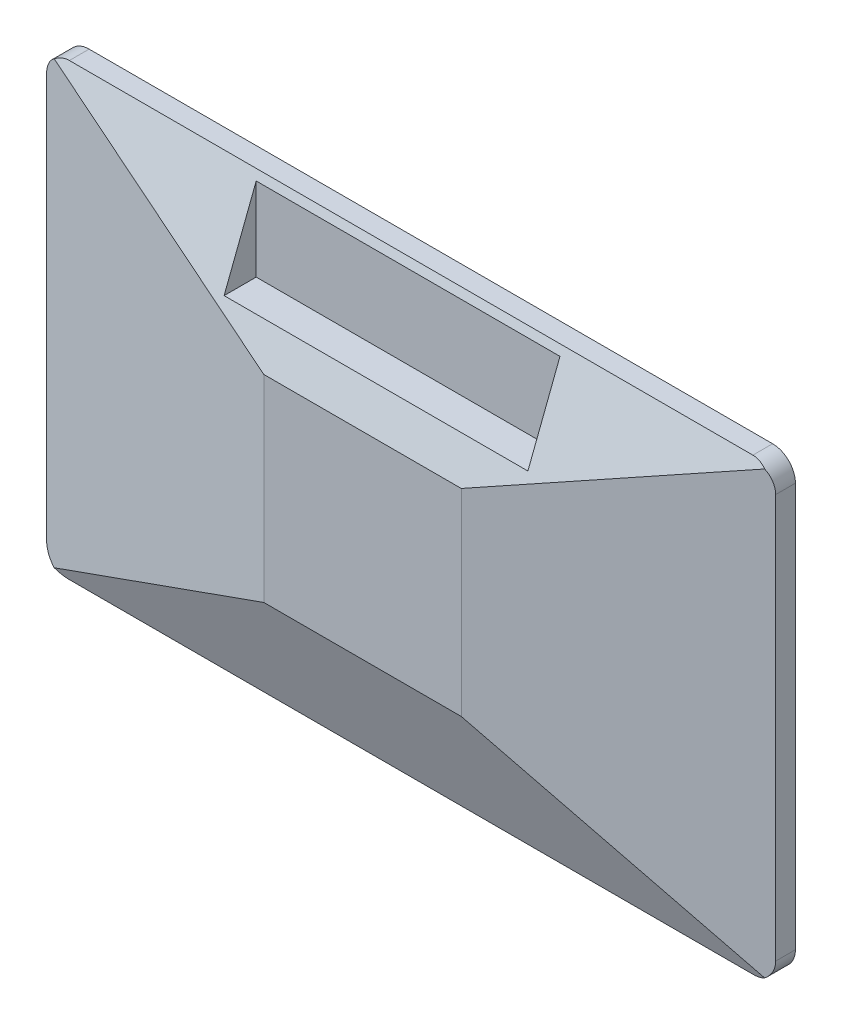
ISO-10303-21;
HEADER;
FILE_DESCRIPTION(('STEP AP214'),'2;1');
FILE_NAME('part.step','',(''),(''),'','','');
FILE_SCHEMA(('AUTOMOTIVE_DESIGN { 1 0 10303 214 1 1 1 1 }'));
ENDSEC;
DATA;
#1=APPLICATION_CONTEXT('core data for automotive mechanical design processes');
#2=APPLICATION_PROTOCOL_DEFINITION('international standard','automotive_design',2000,#1);
#3=PRODUCT_CONTEXT('',#1,'mechanical');
#4=PRODUCT('Part','Part','',(#3));
#5=PRODUCT_RELATED_PRODUCT_CATEGORY('part','',(#4));
#6=PRODUCT_DEFINITION_FORMATION('','',#4);
#7=PRODUCT_DEFINITION_CONTEXT('part definition',#1,'design');
#8=PRODUCT_DEFINITION('design','',#6,#7);
#9=PRODUCT_DEFINITION_SHAPE('','',#8);
#10=(LENGTH_UNIT() NAMED_UNIT(*) SI_UNIT(.MILLI.,.METRE.));
#11=(NAMED_UNIT(*) PLANE_ANGLE_UNIT() SI_UNIT($,.RADIAN.));
#12=(NAMED_UNIT(*) SI_UNIT($,.STERADIAN.) SOLID_ANGLE_UNIT());
#13=UNCERTAINTY_MEASURE_WITH_UNIT(LENGTH_MEASURE(1.E-05),#10,'distance_accuracy_value','');
#14=(GEOMETRIC_REPRESENTATION_CONTEXT(3) GLOBAL_UNCERTAINTY_ASSIGNED_CONTEXT((#13)) GLOBAL_UNIT_ASSIGNED_CONTEXT((#10,
#11,#12)) REPRESENTATION_CONTEXT('',''));
#15=CARTESIAN_POINT('',(0.,0.,0.));
#16=DIRECTION('',(0.,0.,1.));
#17=DIRECTION('',(1.,0.,0.));
#18=AXIS2_PLACEMENT_3D('',#15,#16,#17);
#19=CARTESIAN_POINT('',(0.,0.,0.));
#20=DIRECTION('',(0.,0.,-1.));
#21=DIRECTION('',(-1.,0.,0.));
#22=AXIS2_PLACEMENT_3D('',#19,#20,#21);
#23=PLANE('',#22);
#24=DIRECTION('',(0.,-1.,0.));
#25=VECTOR('',#24,1.);
#26=CARTESIAN_POINT('',(230.,-138.,0.));
#27=LINE('',#26,#25);
#28=CARTESIAN_POINT('',(230.,138.,0.));
#29=VERTEX_POINT('',#28);
#30=CARTESIAN_POINT('',(230.,-138.,0.));
#31=VERTEX_POINT('',#30);
#32=EDGE_CURVE('E345',#29,#31,#27,.T.);
#33=ORIENTED_EDGE('',*,*,#32,.F.);
#34=DIRECTION('',(1.,0.,0.));
#35=VECTOR('',#34,1.);
#36=CARTESIAN_POINT('',(-230.,138.,0.));
#37=LINE('',#36,#35);
#38=CARTESIAN_POINT('',(-230.,138.,0.));
#39=VERTEX_POINT('',#38);
#40=EDGE_CURVE('E350',#39,#29,#37,.T.);
#41=ORIENTED_EDGE('',*,*,#40,.F.);
#42=DIRECTION('',(0.,1.,0.));
#43=VECTOR('',#42,1.);
#44=CARTESIAN_POINT('',(-230.,-138.,0.));
#45=LINE('',#44,#43);
#46=CARTESIAN_POINT('',(-230.,-138.,0.));
#47=VERTEX_POINT('',#46);
#48=EDGE_CURVE('E364',#47,#39,#45,.T.);
#49=ORIENTED_EDGE('',*,*,#48,.F.);
#50=DIRECTION('',(-1.,0.,0.));
#51=VECTOR('',#50,1.);
#52=CARTESIAN_POINT('',(-230.,-138.,0.));
#53=LINE('',#52,#51);
#54=EDGE_CURVE('E361',#31,#47,#53,.T.);
#55=ORIENTED_EDGE('',*,*,#54,.F.);
#56=EDGE_LOOP('',(#33,#41,#49,#55));
#57=FACE_BOUND('',#56,.T.);
#58=DIRECTION('',(0.,1.,0.));
#59=VECTOR('',#58,1.);
#60=CARTESIAN_POINT('',(240.,148.,0.));
#61=LINE('',#60,#59);
#62=CARTESIAN_POINT('',(240.,-133.,0.));
#63=VERTEX_POINT('',#62);
#64=CARTESIAN_POINT('',(240.,133.,0.));
#65=VERTEX_POINT('',#64);
#66=EDGE_CURVE('E650',#63,#65,#61,.T.);
#67=ORIENTED_EDGE('',*,*,#66,.F.);
#68=CARTESIAN_POINT('',(225.,-133.,0.));
#69=DIRECTION('',(0.,0.,-1.));
#70=DIRECTION('',(-1.,0.,0.));
#71=AXIS2_PLACEMENT_3D('',#68,#69,#70);
#72=CIRCLE('',#71,15.);
#73=CARTESIAN_POINT('',(225.,-148.,0.));
#74=VERTEX_POINT('',#73);
#75=EDGE_CURVE('E630',#63,#74,#72,.T.);
#76=ORIENTED_EDGE('',*,*,#75,.T.);
#77=DIRECTION('',(1.,0.,0.));
#78=VECTOR('',#77,1.);
#79=CARTESIAN_POINT('',(240.,-148.,0.));
#80=LINE('',#79,#78);
#81=CARTESIAN_POINT('',(-225.,-148.,0.));
#82=VERTEX_POINT('',#81);
#83=EDGE_CURVE('E647',#82,#74,#80,.T.);
#84=ORIENTED_EDGE('',*,*,#83,.F.);
#85=CARTESIAN_POINT('',(-225.,-133.,0.));
#86=DIRECTION('',(0.,0.,-1.));
#87=DIRECTION('',(-1.,0.,0.));
#88=AXIS2_PLACEMENT_3D('',#85,#86,#87);
#89=CIRCLE('',#88,15.);
#90=CARTESIAN_POINT('',(-240.,-133.,0.));
#91=VERTEX_POINT('',#90);
#92=EDGE_CURVE('E628',#82,#91,#89,.T.);
#93=ORIENTED_EDGE('',*,*,#92,.T.);
#94=DIRECTION('',(0.,-1.,0.));
#95=VECTOR('',#94,1.);
#96=CARTESIAN_POINT('',(-240.,148.,0.));
#97=LINE('',#96,#95);
#98=CARTESIAN_POINT('',(-240.,133.,0.));
#99=VERTEX_POINT('',#98);
#100=EDGE_CURVE('E564',#99,#91,#97,.T.);
#101=ORIENTED_EDGE('',*,*,#100,.F.);
#102=CARTESIAN_POINT('',(-225.,133.,0.));
#103=DIRECTION('',(0.,0.,-1.));
#104=DIRECTION('',(-1.,0.,0.));
#105=AXIS2_PLACEMENT_3D('',#102,#103,#104);
#106=CIRCLE('',#105,15.);
#107=CARTESIAN_POINT('',(-225.,148.,0.));
#108=VERTEX_POINT('',#107);
#109=EDGE_CURVE('E626',#99,#108,#106,.T.);
#110=ORIENTED_EDGE('',*,*,#109,.T.);
#111=DIRECTION('',(-1.,0.,0.));
#112=VECTOR('',#111,1.);
#113=CARTESIAN_POINT('',(240.,148.,0.));
#114=LINE('',#113,#112);
#115=CARTESIAN_POINT('',(225.,148.,0.));
#116=VERTEX_POINT('',#115);
#117=EDGE_CURVE('E592',#116,#108,#114,.T.);
#118=ORIENTED_EDGE('',*,*,#117,.F.);
#119=CARTESIAN_POINT('',(225.,133.,0.));
#120=DIRECTION('',(0.,0.,-1.));
#121=DIRECTION('',(-1.,0.,0.));
#122=AXIS2_PLACEMENT_3D('',#119,#120,#121);
#123=CIRCLE('',#122,15.);
#124=EDGE_CURVE('E624',#116,#65,#123,.T.);
#125=ORIENTED_EDGE('',*,*,#124,.T.);
#126=EDGE_LOOP('',(#67,#76,#84,#93,#101,#110,#118,#125));
#127=FACE_BOUND('',#126,.T.);
#128=DIRECTION('',(-1.,0.,0.));
#129=VECTOR('',#128,1.);
#130=CARTESIAN_POINT('',(200.624292845835,141.,0.));
#131=LINE('',#130,#129);
#132=CARTESIAN_POINT('',(215.624292845835,141.,0.));
#133=VERTEX_POINT('',#132);
#134=CARTESIAN_POINT('',(200.624292845835,141.,0.));
#135=VERTEX_POINT('',#134);
#136=EDGE_CURVE('E318',#133,#135,#131,.T.);
#137=ORIENTED_EDGE('',*,*,#136,.F.);
#138=DIRECTION('',(0.,-1.,0.));
#139=VECTOR('',#138,1.);
#140=CARTESIAN_POINT('',(215.624292845835,141.,0.));
#141=LINE('',#140,#139);
#142=CARTESIAN_POINT('',(215.624292845835,146.,0.));
#143=VERTEX_POINT('',#142);
#144=EDGE_CURVE('E304',#143,#133,#141,.T.);
#145=ORIENTED_EDGE('',*,*,#144,.F.);
#146=DIRECTION('',(1.,0.,0.));
#147=VECTOR('',#146,1.);
#148=CARTESIAN_POINT('',(200.624292845835,146.,0.));
#149=LINE('',#148,#147);
#150=CARTESIAN_POINT('',(200.624292845835,146.,0.));
#151=VERTEX_POINT('',#150);
#152=EDGE_CURVE('E309',#151,#143,#149,.T.);
#153=ORIENTED_EDGE('',*,*,#152,.F.);
#154=DIRECTION('',(0.,1.,0.));
#155=VECTOR('',#154,1.);
#156=CARTESIAN_POINT('',(200.624292845835,141.,0.));
#157=LINE('',#156,#155);
#158=EDGE_CURVE('E320',#135,#151,#157,.T.);
#159=ORIENTED_EDGE('',*,*,#158,.F.);
#160=EDGE_LOOP('',(#137,#145,#153,#159));
#161=FACE_BOUND('',#160,.T.);
#162=DIRECTION('',(-1.,0.,0.));
#163=VECTOR('',#162,1.);
#164=CARTESIAN_POINT('',(177.624292845835,141.,0.));
#165=LINE('',#164,#163);
#166=CARTESIAN_POINT('',(192.624292845835,141.,0.));
#167=VERTEX_POINT('',#166);
#168=CARTESIAN_POINT('',(177.624292845835,141.,0.));
#169=VERTEX_POINT('',#168);
#170=EDGE_CURVE('E276',#167,#169,#165,.T.);
#171=ORIENTED_EDGE('',*,*,#170,.F.);
#172=DIRECTION('',(0.,-1.,0.));
#173=VECTOR('',#172,1.);
#174=CARTESIAN_POINT('',(192.624292845835,141.,0.));
#175=LINE('',#174,#173);
#176=CARTESIAN_POINT('',(192.624292845835,146.,0.));
#177=VERTEX_POINT('',#176);
#178=EDGE_CURVE('E273',#177,#167,#175,.T.);
#179=ORIENTED_EDGE('',*,*,#178,.F.);
#180=DIRECTION('',(1.,0.,0.));
#181=VECTOR('',#180,1.);
#182=CARTESIAN_POINT('',(177.624292845835,146.,0.));
#183=LINE('',#182,#181);
#184=CARTESIAN_POINT('',(177.624292845835,146.,0.));
#185=VERTEX_POINT('',#184);
#186=EDGE_CURVE('E285',#185,#177,#183,.T.);
#187=ORIENTED_EDGE('',*,*,#186,.F.);
#188=DIRECTION('',(0.,1.,0.));
#189=VECTOR('',#188,1.);
#190=CARTESIAN_POINT('',(177.624292845835,141.,0.));
#191=LINE('',#190,#189);
#192=EDGE_CURVE('E293',#169,#185,#191,.T.);
#193=ORIENTED_EDGE('',*,*,#192,.F.);
#194=EDGE_LOOP('',(#171,#179,#187,#193));
#195=FACE_BOUND('',#194,.T.);
#196=DIRECTION('',(-1.,0.,0.));
#197=VECTOR('',#196,1.);
#198=CARTESIAN_POINT('',(154.624292845835,141.,0.));
#199=LINE('',#198,#197);
#200=CARTESIAN_POINT('',(169.624292845835,141.,0.));
#201=VERTEX_POINT('',#200);
#202=CARTESIAN_POINT('',(154.624292845835,141.,0.));
#203=VERTEX_POINT('',#202);
#204=EDGE_CURVE('E685',#201,#203,#199,.T.);
#205=ORIENTED_EDGE('',*,*,#204,.F.);
#206=DIRECTION('',(0.,-1.,0.));
#207=VECTOR('',#206,1.);
#208=CARTESIAN_POINT('',(169.624292845835,141.,0.));
#209=LINE('',#208,#207);
#210=CARTESIAN_POINT('',(169.624292845835,146.,0.));
#211=VERTEX_POINT('',#210);
#212=EDGE_CURVE('E271',#211,#201,#209,.T.);
#213=ORIENTED_EDGE('',*,*,#212,.F.);
#214=DIRECTION('',(1.,0.,0.));
#215=VECTOR('',#214,1.);
#216=CARTESIAN_POINT('',(154.624292845835,146.,0.));
#217=LINE('',#216,#215);
#218=CARTESIAN_POINT('',(154.624292845835,146.,0.));
#219=VERTEX_POINT('',#218);
#220=EDGE_CURVE('E267',#219,#211,#217,.T.);
#221=ORIENTED_EDGE('',*,*,#220,.F.);
#222=DIRECTION('',(0.,1.,0.));
#223=VECTOR('',#222,1.);
#224=CARTESIAN_POINT('',(154.624292845835,141.,0.));
#225=LINE('',#224,#223);
#226=EDGE_CURVE('E687',#203,#219,#225,.T.);
#227=ORIENTED_EDGE('',*,*,#226,.F.);
#228=EDGE_LOOP('',(#205,#213,#221,#227));
#229=FACE_BOUND('',#228,.T.);
#230=ADVANCED_FACE('F44',(#57,#127,#161,#195,#229),#23,.T.);
#231=CARTESIAN_POINT('',(0.,23.5157336029319,60.9939340326046));
#232=DIRECTION('',(0.,0.359732267715504,0.933055569387087));
#233=DIRECTION('',(0.,-0.933055569387087,0.359732267715504));
#234=AXIS2_PLACEMENT_3D('',#231,#232,#233);
#235=PLANE('',#234);
#236=DIRECTION('',(1.,0.,0.));
#237=VECTOR('',#236,1.);
#238=CARTESIAN_POINT('',(0.,148.,13.));
#239=LINE('',#238,#237);
#240=CARTESIAN_POINT('',(225.,148.,13.));
#241=VERTEX_POINT('',#240);
#242=CARTESIAN_POINT('',(-225.,148.,13.));
#243=VERTEX_POINT('',#242);
#244=EDGE_CURVE('E607',#241,#243,#239,.F.);
#245=ORIENTED_EDGE('',*,*,#244,.T.);
#246=CARTESIAN_POINT('',(-225.,133.,18.7831325301205));
#247=DIRECTION('',(0.,0.359732267715504,0.933055569387087));
#248=DIRECTION('',(0.,0.933055569387087,-0.359732267715504));
#249=AXIS2_PLACEMENT_3D('',#246,#247,#248);
#250=ELLIPSE('',#249,16.0762129203658,15.);
#251=CARTESIAN_POINT('',(-233.873129749235,145.09411296678,14.1203419887113));
#252=VERTEX_POINT('',#251);
#253=EDGE_CURVE('E445',#243,#252,#250,.T.);
#254=ORIENTED_EDGE('',*,*,#253,.T.);
#255=DIRECTION('',(-0.891442760726142,0.422798566515827,-0.163006676247066));
#256=VECTOR('',#255,1.);
#257=CARTESIAN_POINT('',(-65.,65.,45.));
#258=LINE('',#257,#256);
#259=CARTESIAN_POINT('',(-65.,65.,45.));
#260=VERTEX_POINT('',#259);
#261=EDGE_CURVE('E562',#260,#252,#258,.T.);
#262=ORIENTED_EDGE('',*,*,#261,.F.);
#263=DIRECTION('',(-1.,0.,0.));
#264=VECTOR('',#263,1.);
#265=CARTESIAN_POINT('',(-65.,65.,45.));
#266=LINE('',#265,#264);
#267=CARTESIAN_POINT('',(65.,65.,45.));
#268=VERTEX_POINT('',#267);
#269=EDGE_CURVE('E533',#268,#260,#266,.T.);
#270=ORIENTED_EDGE('',*,*,#269,.F.);
#271=DIRECTION('',(0.891442760726142,0.422798566515828,-0.163006676247066));
#272=VECTOR('',#271,1.);
#273=CARTESIAN_POINT('',(65.,65.,45.));
#274=LINE('',#273,#272);
#275=CARTESIAN_POINT('',(233.873129749235,145.09411296678,14.1203419887113));
#276=VERTEX_POINT('',#275);
#277=EDGE_CURVE('E549',#268,#276,#274,.T.);
#278=ORIENTED_EDGE('',*,*,#277,.T.);
#279=CARTESIAN_POINT('',(225.,133.,18.7831325301205));
#280=DIRECTION('',(0.,0.359732267715504,0.933055569387087));
#281=DIRECTION('',(0.,0.933055569387087,-0.359732267715504));
#282=AXIS2_PLACEMENT_3D('',#279,#280,#281);
#283=ELLIPSE('',#282,16.0762129203658,15.);
#284=EDGE_CURVE('E454',#276,#241,#283,.T.);
#285=ORIENTED_EDGE('',*,*,#284,.T.);
#286=EDGE_LOOP('',(#245,#254,#262,#270,#278,#285));
#287=FACE_BOUND('',#286,.T.);
#288=DIRECTION('',(0.,0.933055569387087,-0.359732267715504));
#289=VECTOR('',#288,1.);
#290=CARTESIAN_POINT('',(-100.,23.5157336029319,60.9939340326046));
#291=LINE('',#290,#289);
#292=CARTESIAN_POINT('',(-100.,88.,36.132530120482));
#293=VERTEX_POINT('',#292);
#294=CARTESIAN_POINT('',(-100.,142.8125,15.0000000000001));
#295=VERTEX_POINT('',#294);
#296=EDGE_CURVE('E52',#293,#295,#291,.T.);
#297=ORIENTED_EDGE('',*,*,#296,.T.);
#298=DIRECTION('',(1.,0.,0.));
#299=VECTOR('',#298,1.);
#300=CARTESIAN_POINT('',(-1.00610926034179E-13,142.8125,15.));
#301=LINE('',#300,#299);
#302=CARTESIAN_POINT('',(99.9999999999999,142.8125,15.));
#303=VERTEX_POINT('',#302);
#304=EDGE_CURVE('E12',#295,#303,#301,.T.);
#305=ORIENTED_EDGE('',*,*,#304,.T.);
#306=DIRECTION('',(0.,-0.933055569387087,0.359732267715504));
#307=VECTOR('',#306,1.);
#308=CARTESIAN_POINT('',(100.,23.5157336029319,60.9939340326046));
#309=LINE('',#308,#307);
#310=CARTESIAN_POINT('',(100.,88.,36.132530120482));
#311=VERTEX_POINT('',#310);
#312=EDGE_CURVE('E457',#303,#311,#309,.T.);
#313=ORIENTED_EDGE('',*,*,#312,.T.);
#314=DIRECTION('',(-1.,0.,0.));
#315=VECTOR('',#314,1.);
#316=CARTESIAN_POINT('',(0.,88.,36.132530120482));
#317=LINE('',#316,#315);
#318=EDGE_CURVE('E453',#311,#293,#317,.T.);
#319=ORIENTED_EDGE('',*,*,#318,.T.);
#320=EDGE_LOOP('',(#297,#305,#313,#319));
#321=FACE_BOUND('',#320,.T.);
#322=ADVANCED_FACE('F407',(#287,#321),#235,.T.);
#323=CARTESIAN_POINT('',(-240.,148.,13.));
#324=DIRECTION('',(1.,0.,0.));
#325=DIRECTION('',(0.,1.,0.));
#326=AXIS2_PLACEMENT_3D('',#323,#324,#325);
#327=PLANE('',#326);
#328=ORIENTED_EDGE('',*,*,#100,.T.);
#329=DIRECTION('',(0.,0.,-1.));
#330=VECTOR('',#329,1.);
#331=CARTESIAN_POINT('',(-240.,-133.,13.));
#332=LINE('',#331,#330);
#333=CARTESIAN_POINT('',(-240.,-133.,13.));
#334=VERTEX_POINT('',#333);
#335=EDGE_CURVE('E596',#91,#334,#332,.F.);
#336=ORIENTED_EDGE('',*,*,#335,.T.);
#337=DIRECTION('',(0.,1.,0.));
#338=VECTOR('',#337,1.);
#339=CARTESIAN_POINT('',(-240.,0.,13.));
#340=LINE('',#339,#338);
#341=CARTESIAN_POINT('',(-240.,133.,13.));
#342=VERTEX_POINT('',#341);
#343=EDGE_CURVE('E587',#342,#334,#340,.F.);
#344=ORIENTED_EDGE('',*,*,#343,.F.);
#345=DIRECTION('',(0.,0.,-1.));
#346=VECTOR('',#345,1.);
#347=CARTESIAN_POINT('',(-240.,133.,13.));
#348=LINE('',#347,#346);
#349=EDGE_CURVE('E643',#342,#99,#348,.T.);
#350=ORIENTED_EDGE('',*,*,#349,.T.);
#351=EDGE_LOOP('',(#328,#336,#344,#350));
#352=FACE_BOUND('',#351,.T.);
#353=ADVANCED_FACE('F421',(#352),#327,.F.);
#354=CARTESIAN_POINT('',(240.,-148.,13.));
#355=DIRECTION('',(0.,1.,0.));
#356=DIRECTION('',(-1.,0.,0.));
#357=AXIS2_PLACEMENT_3D('',#354,#355,#356);
#358=PLANE('',#357);
#359=ORIENTED_EDGE('',*,*,#83,.T.);
#360=DIRECTION('',(0.,0.,-1.));
#361=VECTOR('',#360,1.);
#362=CARTESIAN_POINT('',(225.,-148.,13.));
#363=LINE('',#362,#361);
#364=CARTESIAN_POINT('',(225.,-148.,13.));
#365=VERTEX_POINT('',#364);
#366=EDGE_CURVE('E635',#74,#365,#363,.F.);
#367=ORIENTED_EDGE('',*,*,#366,.T.);
#368=DIRECTION('',(1.,0.,0.));
#369=VECTOR('',#368,1.);
#370=CARTESIAN_POINT('',(0.,-148.,13.));
#371=LINE('',#370,#369);
#372=CARTESIAN_POINT('',(-225.,-148.,13.));
#373=VERTEX_POINT('',#372);
#374=EDGE_CURVE('E591',#373,#365,#371,.T.);
#375=ORIENTED_EDGE('',*,*,#374,.F.);
#376=DIRECTION('',(0.,0.,-1.));
#377=VECTOR('',#376,1.);
#378=CARTESIAN_POINT('',(-225.,-148.,13.));
#379=LINE('',#378,#377);
#380=EDGE_CURVE('E632',#373,#82,#379,.T.);
#381=ORIENTED_EDGE('',*,*,#380,.T.);
#382=EDGE_LOOP('',(#359,#367,#375,#381));
#383=FACE_BOUND('',#382,.T.);
#384=ADVANCED_FACE('F417',(#383),#358,.F.);
#385=CARTESIAN_POINT('',(240.,148.,13.));
#386=DIRECTION('',(-1.,0.,0.));
#387=DIRECTION('',(0.,-1.,0.));
#388=AXIS2_PLACEMENT_3D('',#385,#386,#387);
#389=PLANE('',#388);
#390=DIRECTION('',(0.,1.,0.));
#391=VECTOR('',#390,1.);
#392=CARTESIAN_POINT('',(240.,0.,13.));
#393=LINE('',#392,#391);
#394=CARTESIAN_POINT('',(240.,-133.,13.));
#395=VERTEX_POINT('',#394);
#396=CARTESIAN_POINT('',(240.,133.,13.));
#397=VERTEX_POINT('',#396);
#398=EDGE_CURVE('E612',#395,#397,#393,.T.);
#399=ORIENTED_EDGE('',*,*,#398,.F.);
#400=DIRECTION('',(0.,0.,-1.));
#401=VECTOR('',#400,1.);
#402=CARTESIAN_POINT('',(240.,-133.,13.));
#403=LINE('',#402,#401);
#404=EDGE_CURVE('E614',#395,#63,#403,.T.);
#405=ORIENTED_EDGE('',*,*,#404,.T.);
#406=ORIENTED_EDGE('',*,*,#66,.T.);
#407=DIRECTION('',(0.,0.,-1.));
#408=VECTOR('',#407,1.);
#409=CARTESIAN_POINT('',(240.,133.,13.));
#410=LINE('',#409,#408);
#411=EDGE_CURVE('E611',#65,#397,#410,.F.);
#412=ORIENTED_EDGE('',*,*,#411,.T.);
#413=EDGE_LOOP('',(#399,#405,#406,#412));
#414=FACE_BOUND('',#413,.T.);
#415=ADVANCED_FACE('F413',(#414),#389,.F.);
#416=CARTESIAN_POINT('',(240.,148.,13.));
#417=DIRECTION('',(0.,-1.,0.));
#418=DIRECTION('',(1.,0.,0.));
#419=AXIS2_PLACEMENT_3D('',#416,#417,#418);
#420=PLANE('',#419);
#421=ORIENTED_EDGE('',*,*,#117,.T.);
#422=DIRECTION('',(0.,0.,-1.));
#423=VECTOR('',#422,1.);
#424=CARTESIAN_POINT('',(-225.,148.,13.));
#425=LINE('',#424,#423);
#426=EDGE_CURVE('E446',#108,#243,#425,.F.);
#427=ORIENTED_EDGE('',*,*,#426,.T.);
#428=ORIENTED_EDGE('',*,*,#244,.F.);
#429=DIRECTION('',(0.,0.,-1.));
#430=VECTOR('',#429,1.);
#431=CARTESIAN_POINT('',(225.,148.,13.));
#432=LINE('',#431,#430);
#433=EDGE_CURVE('E599',#241,#116,#432,.T.);
#434=ORIENTED_EDGE('',*,*,#433,.T.);
#435=EDGE_LOOP('',(#421,#427,#428,#434));
#436=FACE_BOUND('',#435,.T.);
#437=ADVANCED_FACE('F409',(#436),#420,.F.);
#438=CARTESIAN_POINT('',(0.,0.,45.));
#439=DIRECTION('',(0.,0.,-1.));
#440=DIRECTION('',(-1.,0.,0.));
#441=AXIS2_PLACEMENT_3D('',#438,#439,#440);
#442=PLANE('',#441);
#443=DIRECTION('',(0.,1.,0.));
#444=VECTOR('',#443,1.);
#445=CARTESIAN_POINT('',(65.,-65.,45.));
#446=LINE('',#445,#444);
#447=CARTESIAN_POINT('',(65.,-65.,45.));
#448=VERTEX_POINT('',#447);
#449=EDGE_CURVE('E371',#448,#268,#446,.T.);
#450=ORIENTED_EDGE('',*,*,#449,.T.);
#451=ORIENTED_EDGE('',*,*,#269,.T.);
#452=DIRECTION('',(0.,-1.,0.));
#453=VECTOR('',#452,1.);
#454=CARTESIAN_POINT('',(-65.,-65.,45.));
#455=LINE('',#454,#453);
#456=CARTESIAN_POINT('',(-65.,-65.,45.));
#457=VERTEX_POINT('',#456);
#458=EDGE_CURVE('E540',#260,#457,#455,.T.);
#459=ORIENTED_EDGE('',*,*,#458,.T.);
#460=DIRECTION('',(1.,0.,0.));
#461=VECTOR('',#460,1.);
#462=CARTESIAN_POINT('',(-65.,-65.,45.));
#463=LINE('',#462,#461);
#464=EDGE_CURVE('E383',#457,#448,#463,.T.);
#465=ORIENTED_EDGE('',*,*,#464,.T.);
#466=EDGE_LOOP('',(#450,#451,#459,#465));
#467=FACE_BOUND('',#466,.T.);
#468=ADVANCED_FACE('F412',(#467),#442,.F.);
#469=CARTESIAN_POINT('',(-10.0654049101077,0.,55.0451831021517));
#470=DIRECTION('',(-0.179874658386411,0.,0.983689538050686));
#471=DIRECTION('',(0.983689538050686,0.,0.179874658386411));
#472=AXIS2_PLACEMENT_3D('',#469,#470,#471);
#473=PLANE('',#472);
#474=ORIENTED_EDGE('',*,*,#343,.T.);
#475=CARTESIAN_POINT('',(-225.,-133.,15.7428571428571));
#476=DIRECTION('',(-0.179874658386411,0.,0.983689538050686));
#477=DIRECTION('',(-0.983689538050686,0.,-0.179874658386411));
#478=AXIS2_PLACEMENT_3D('',#475,#476,#477);
#479=ELLIPSE('',#478,15.2487135623344,15.);
#480=CARTESIAN_POINT('',(-233.873129749235,-145.09411296678,14.1203419887113));
#481=VERTEX_POINT('',#480);
#482=EDGE_CURVE('E589',#334,#481,#479,.T.);
#483=ORIENTED_EDGE('',*,*,#482,.T.);
#484=DIRECTION('',(-0.891442760726142,-0.422798566515828,-0.163006676247066));
#485=VECTOR('',#484,1.);
#486=CARTESIAN_POINT('',(-65.,-65.,45.));
#487=LINE('',#486,#485);
#488=EDGE_CURVE('E389',#457,#481,#487,.T.);
#489=ORIENTED_EDGE('',*,*,#488,.F.);
#490=ORIENTED_EDGE('',*,*,#458,.F.);
#491=ORIENTED_EDGE('',*,*,#261,.T.);
#492=CARTESIAN_POINT('',(-225.,133.,15.7428571428571));
#493=DIRECTION('',(-0.179874658386411,0.,0.983689538050686));
#494=DIRECTION('',(-0.983689538050686,0.,-0.179874658386411));
#495=AXIS2_PLACEMENT_3D('',#492,#493,#494);
#496=ELLIPSE('',#495,15.2487135623344,15.);
#497=EDGE_CURVE('E448',#252,#342,#496,.T.);
#498=ORIENTED_EDGE('',*,*,#497,.T.);
#499=EDGE_LOOP('',(#474,#483,#489,#490,#491,#498));
#500=FACE_BOUND('',#499,.T.);
#501=ADVANCED_FACE('F509',(#500),#473,.T.);
#502=CARTESIAN_POINT('',(10.0654049101077,0.,55.0451831021517));
#503=DIRECTION('',(0.179874658386411,0.,0.983689538050686));
#504=DIRECTION('',(0.983689538050686,0.,-0.179874658386411));
#505=AXIS2_PLACEMENT_3D('',#502,#503,#504);
#506=PLANE('',#505);
#507=DIRECTION('',(0.891442760726142,-0.422798566515828,-0.163006676247066));
#508=VECTOR('',#507,1.);
#509=CARTESIAN_POINT('',(65.,-65.,45.));
#510=LINE('',#509,#508);
#511=CARTESIAN_POINT('',(233.873129749235,-145.09411296678,14.1203419887113));
#512=VERTEX_POINT('',#511);
#513=EDGE_CURVE('E555',#448,#512,#510,.T.);
#514=ORIENTED_EDGE('',*,*,#513,.T.);
#515=CARTESIAN_POINT('',(225.,-133.,15.7428571428571));
#516=DIRECTION('',(0.179874658386411,0.,0.983689538050686));
#517=DIRECTION('',(0.983689538050686,0.,-0.179874658386411));
#518=AXIS2_PLACEMENT_3D('',#515,#516,#517);
#519=ELLIPSE('',#518,15.2487135623344,15.);
#520=EDGE_CURVE('E641',#512,#395,#519,.T.);
#521=ORIENTED_EDGE('',*,*,#520,.T.);
#522=ORIENTED_EDGE('',*,*,#398,.T.);
#523=CARTESIAN_POINT('',(225.,133.,15.7428571428571));
#524=DIRECTION('',(0.179874658386411,0.,0.983689538050686));
#525=DIRECTION('',(0.983689538050686,0.,-0.179874658386411));
#526=AXIS2_PLACEMENT_3D('',#523,#524,#525);
#527=ELLIPSE('',#526,15.2487135623344,15.);
#528=EDGE_CURVE('E639',#397,#276,#527,.T.);
#529=ORIENTED_EDGE('',*,*,#528,.T.);
#530=ORIENTED_EDGE('',*,*,#277,.F.);
#531=ORIENTED_EDGE('',*,*,#449,.F.);
#532=EDGE_LOOP('',(#514,#521,#522,#529,#530,#531));
#533=FACE_BOUND('',#532,.T.);
#534=ADVANCED_FACE('F402',(#533),#506,.T.);
#535=CARTESIAN_POINT('',(0.,-23.5157336029319,60.9939340326046));
#536=DIRECTION('',(0.,-0.359732267715503,0.933055569387087));
#537=DIRECTION('',(0.,-0.933055569387087,-0.359732267715503));
#538=AXIS2_PLACEMENT_3D('',#535,#536,#537);
#539=PLANE('',#538);
#540=ORIENTED_EDGE('',*,*,#374,.T.);
#541=CARTESIAN_POINT('',(225.,-133.,18.7831325301205));
#542=DIRECTION('',(0.,-0.359732267715503,0.933055569387087));
#543=DIRECTION('',(0.,-0.933055569387087,-0.359732267715503));
#544=AXIS2_PLACEMENT_3D('',#541,#542,#543);
#545=ELLIPSE('',#544,16.0762129203658,15.);
#546=EDGE_CURVE('E561',#365,#512,#545,.T.);
#547=ORIENTED_EDGE('',*,*,#546,.T.);
#548=ORIENTED_EDGE('',*,*,#513,.F.);
#549=ORIENTED_EDGE('',*,*,#464,.F.);
#550=ORIENTED_EDGE('',*,*,#488,.T.);
#551=CARTESIAN_POINT('',(-225.,-133.,18.7831325301205));
#552=DIRECTION('',(0.,-0.359732267715503,0.933055569387087));
#553=DIRECTION('',(0.,-0.933055569387087,-0.359732267715503));
#554=AXIS2_PLACEMENT_3D('',#551,#552,#553);
#555=ELLIPSE('',#554,16.0762129203658,15.);
#556=EDGE_CURVE('E598',#481,#373,#555,.T.);
#557=ORIENTED_EDGE('',*,*,#556,.T.);
#558=EDGE_LOOP('',(#540,#547,#548,#549,#550,#557));
#559=FACE_BOUND('',#558,.T.);
#560=ADVANCED_FACE('F391',(#559),#539,.T.);
#561=CARTESIAN_POINT('',(230.,-138.,2.));
#562=DIRECTION('',(1.,0.,0.));
#563=DIRECTION('',(0.,0.,-1.));
#564=AXIS2_PLACEMENT_3D('',#561,#562,#563);
#565=PLANE('',#564);
#566=ORIENTED_EDGE('',*,*,#32,.T.);
#567=DIRECTION('',(0.,0.,-1.));
#568=VECTOR('',#567,1.);
#569=CARTESIAN_POINT('',(230.,-138.,2.));
#570=LINE('',#569,#568);
#571=CARTESIAN_POINT('',(230.,-138.,2.));
#572=VERTEX_POINT('',#571);
#573=EDGE_CURVE('E359',#572,#31,#570,.T.);
#574=ORIENTED_EDGE('',*,*,#573,.F.);
#575=DIRECTION('',(0.,-1.,0.));
#576=VECTOR('',#575,1.);
#577=CARTESIAN_POINT('',(230.,-138.,2.));
#578=LINE('',#577,#576);
#579=CARTESIAN_POINT('',(230.,138.,2.));
#580=VERTEX_POINT('',#579);
#581=EDGE_CURVE('E346',#580,#572,#578,.T.);
#582=ORIENTED_EDGE('',*,*,#581,.F.);
#583=DIRECTION('',(0.,0.,-1.));
#584=VECTOR('',#583,1.);
#585=CARTESIAN_POINT('',(230.,138.,2.));
#586=LINE('',#585,#584);
#587=EDGE_CURVE('E369',#580,#29,#586,.T.);
#588=ORIENTED_EDGE('',*,*,#587,.T.);
#589=EDGE_LOOP('',(#566,#574,#582,#588));
#590=FACE_BOUND('',#589,.T.);
#591=ADVANCED_FACE('F401',(#590),#565,.F.);
#592=CARTESIAN_POINT('',(-230.,138.,2.));
#593=DIRECTION('',(0.,1.,0.));
#594=DIRECTION('',(0.,0.,1.));
#595=AXIS2_PLACEMENT_3D('',#592,#593,#594);
#596=PLANE('',#595);
#597=ORIENTED_EDGE('',*,*,#40,.T.);
#598=ORIENTED_EDGE('',*,*,#587,.F.);
#599=DIRECTION('',(1.,0.,0.));
#600=VECTOR('',#599,1.);
#601=CARTESIAN_POINT('',(-230.,138.,2.));
#602=LINE('',#601,#600);
#603=CARTESIAN_POINT('',(-230.,138.,2.));
#604=VERTEX_POINT('',#603);
#605=EDGE_CURVE('E356',#604,#580,#602,.T.);
#606=ORIENTED_EDGE('',*,*,#605,.F.);
#607=DIRECTION('',(0.,0.,-1.));
#608=VECTOR('',#607,1.);
#609=CARTESIAN_POINT('',(-230.,138.,2.));
#610=LINE('',#609,#608);
#611=EDGE_CURVE('E372',#604,#39,#610,.T.);
#612=ORIENTED_EDGE('',*,*,#611,.T.);
#613=EDGE_LOOP('',(#597,#598,#606,#612));
#614=FACE_BOUND('',#613,.T.);
#615=ADVANCED_FACE('F492',(#614),#596,.F.);
#616=CARTESIAN_POINT('',(-230.,-138.,2.));
#617=DIRECTION('',(-1.,0.,0.));
#618=DIRECTION('',(0.,0.,1.));
#619=AXIS2_PLACEMENT_3D('',#616,#617,#618);
#620=PLANE('',#619);
#621=ORIENTED_EDGE('',*,*,#48,.T.);
#622=ORIENTED_EDGE('',*,*,#611,.F.);
#623=DIRECTION('',(0.,1.,0.));
#624=VECTOR('',#623,1.);
#625=CARTESIAN_POINT('',(-230.,-138.,2.));
#626=LINE('',#625,#624);
#627=CARTESIAN_POINT('',(-230.,-138.,2.));
#628=VERTEX_POINT('',#627);
#629=EDGE_CURVE('E353',#628,#604,#626,.T.);
#630=ORIENTED_EDGE('',*,*,#629,.F.);
#631=DIRECTION('',(0.,0.,-1.));
#632=VECTOR('',#631,1.);
#633=CARTESIAN_POINT('',(-230.,-138.,2.));
#634=LINE('',#633,#632);
#635=EDGE_CURVE('E374',#628,#47,#634,.T.);
#636=ORIENTED_EDGE('',*,*,#635,.T.);
#637=EDGE_LOOP('',(#621,#622,#630,#636));
#638=FACE_BOUND('',#637,.T.);
#639=ADVANCED_FACE('F495',(#638),#620,.F.);
#640=CARTESIAN_POINT('',(-230.,-138.,2.));
#641=DIRECTION('',(0.,-1.,0.));
#642=DIRECTION('',(0.,0.,-1.));
#643=AXIS2_PLACEMENT_3D('',#640,#641,#642);
#644=PLANE('',#643);
#645=ORIENTED_EDGE('',*,*,#54,.T.);
#646=ORIENTED_EDGE('',*,*,#635,.F.);
#647=DIRECTION('',(-1.,0.,0.));
#648=VECTOR('',#647,1.);
#649=CARTESIAN_POINT('',(-230.,-138.,2.));
#650=LINE('',#649,#648);
#651=EDGE_CURVE('E349',#572,#628,#650,.T.);
#652=ORIENTED_EDGE('',*,*,#651,.F.);
#653=ORIENTED_EDGE('',*,*,#573,.T.);
#654=EDGE_LOOP('',(#645,#646,#652,#653));
#655=FACE_BOUND('',#654,.T.);
#656=ADVANCED_FACE('F490',(#655),#644,.F.);
#657=CARTESIAN_POINT('',(0.,0.,2.));
#658=DIRECTION('',(0.,0.,-1.));
#659=DIRECTION('',(-1.,0.,0.));
#660=AXIS2_PLACEMENT_3D('',#657,#658,#659);
#661=PLANE('',#660);
#662=ORIENTED_EDGE('',*,*,#581,.T.);
#663=ORIENTED_EDGE('',*,*,#651,.T.);
#664=ORIENTED_EDGE('',*,*,#629,.T.);
#665=ORIENTED_EDGE('',*,*,#605,.T.);
#666=EDGE_LOOP('',(#662,#663,#664,#665));
#667=FACE_BOUND('',#666,.T.);
#668=ADVANCED_FACE('F430',(#667),#661,.T.);
#669=CARTESIAN_POINT('',(225.,-133.,13.));
#670=DIRECTION('',(0.,0.,-1.));
#671=DIRECTION('',(-1.,0.,0.));
#672=AXIS2_PLACEMENT_3D('',#669,#670,#671);
#673=CYLINDRICAL_SURFACE('',#672,15.);
#674=ORIENTED_EDGE('',*,*,#546,.F.);
#675=ORIENTED_EDGE('',*,*,#366,.F.);
#676=ORIENTED_EDGE('',*,*,#75,.F.);
#677=ORIENTED_EDGE('',*,*,#404,.F.);
#678=ORIENTED_EDGE('',*,*,#520,.F.);
#679=EDGE_LOOP('',(#674,#675,#676,#677,#678));
#680=FACE_BOUND('',#679,.T.);
#681=ADVANCED_FACE('F426',(#680),#673,.T.);
#682=CARTESIAN_POINT('',(-225.,-133.,13.));
#683=DIRECTION('',(0.,0.,-1.));
#684=DIRECTION('',(-1.,0.,0.));
#685=AXIS2_PLACEMENT_3D('',#682,#683,#684);
#686=CYLINDRICAL_SURFACE('',#685,15.);
#687=ORIENTED_EDGE('',*,*,#482,.F.);
#688=ORIENTED_EDGE('',*,*,#335,.F.);
#689=ORIENTED_EDGE('',*,*,#92,.F.);
#690=ORIENTED_EDGE('',*,*,#380,.F.);
#691=ORIENTED_EDGE('',*,*,#556,.F.);
#692=EDGE_LOOP('',(#687,#688,#689,#690,#691));
#693=FACE_BOUND('',#692,.T.);
#694=ADVANCED_FACE('F429',(#693),#686,.T.);
#695=CARTESIAN_POINT('',(-225.,133.,13.));
#696=DIRECTION('',(0.,0.,-1.));
#697=DIRECTION('',(-1.,0.,0.));
#698=AXIS2_PLACEMENT_3D('',#695,#696,#697);
#699=CYLINDRICAL_SURFACE('',#698,15.);
#700=ORIENTED_EDGE('',*,*,#253,.F.);
#701=ORIENTED_EDGE('',*,*,#426,.F.);
#702=ORIENTED_EDGE('',*,*,#109,.F.);
#703=ORIENTED_EDGE('',*,*,#349,.F.);
#704=ORIENTED_EDGE('',*,*,#497,.F.);
#705=EDGE_LOOP('',(#700,#701,#702,#703,#704));
#706=FACE_BOUND('',#705,.T.);
#707=ADVANCED_FACE('F433',(#706),#699,.T.);
#708=CARTESIAN_POINT('',(225.,133.,13.));
#709=DIRECTION('',(0.,0.,-1.));
#710=DIRECTION('',(-1.,0.,0.));
#711=AXIS2_PLACEMENT_3D('',#708,#709,#710);
#712=CYLINDRICAL_SURFACE('',#711,15.);
#713=ORIENTED_EDGE('',*,*,#528,.F.);
#714=ORIENTED_EDGE('',*,*,#411,.F.);
#715=ORIENTED_EDGE('',*,*,#124,.F.);
#716=ORIENTED_EDGE('',*,*,#433,.F.);
#717=ORIENTED_EDGE('',*,*,#284,.F.);
#718=EDGE_LOOP('',(#713,#714,#715,#716,#717));
#719=FACE_BOUND('',#718,.T.);
#720=ADVANCED_FACE('F46',(#719),#712,.T.);
#721=CARTESIAN_POINT('',(-100.,148.,68.0296756383714));
#722=DIRECTION('',(1.,0.,0.));
#723=DIRECTION('',(0.,0.,-1.));
#724=AXIS2_PLACEMENT_3D('',#721,#722,#723);
#725=PLANE('',#724);
#726=DIRECTION('',(0.,0.,1.));
#727=VECTOR('',#726,1.);
#728=CARTESIAN_POINT('',(-100.,88.,68.0296756383714));
#729=LINE('',#728,#727);
#730=CARTESIAN_POINT('',(-100.,88.,15.0000000000001));
#731=VERTEX_POINT('',#730);
#732=EDGE_CURVE('E333',#731,#293,#729,.T.);
#733=ORIENTED_EDGE('',*,*,#732,.F.);
#734=DIRECTION('',(0.,-1.,0.));
#735=VECTOR('',#734,1.);
#736=CARTESIAN_POINT('',(-100.,148.,15.0000000000001));
#737=LINE('',#736,#735);
#738=EDGE_CURVE('E341',#295,#731,#737,.T.);
#739=ORIENTED_EDGE('',*,*,#738,.F.);
#740=ORIENTED_EDGE('',*,*,#296,.F.);
#741=EDGE_LOOP('',(#733,#739,#740));
#742=FACE_BOUND('',#741,.T.);
#743=ADVANCED_FACE('F440',(#742),#725,.T.);
#744=CARTESIAN_POINT('',(99.9999999999999,148.,68.0296756383713));
#745=DIRECTION('',(-1.,0.,0.));
#746=DIRECTION('',(0.,0.,1.));
#747=AXIS2_PLACEMENT_3D('',#744,#745,#746);
#748=PLANE('',#747);
#749=DIRECTION('',(0.,-1.,0.));
#750=VECTOR('',#749,1.);
#751=CARTESIAN_POINT('',(99.9999999999999,148.,15.));
#752=LINE('',#751,#750);
#753=CARTESIAN_POINT('',(100.,88.,15.));
#754=VERTEX_POINT('',#753);
#755=EDGE_CURVE('E343',#303,#754,#752,.T.);
#756=ORIENTED_EDGE('',*,*,#755,.T.);
#757=DIRECTION('',(0.,0.,-1.));
#758=VECTOR('',#757,1.);
#759=CARTESIAN_POINT('',(99.9999999999999,88.,68.0296756383713));
#760=LINE('',#759,#758);
#761=EDGE_CURVE('E335',#311,#754,#760,.T.);
#762=ORIENTED_EDGE('',*,*,#761,.F.);
#763=ORIENTED_EDGE('',*,*,#312,.F.);
#764=EDGE_LOOP('',(#756,#762,#763));
#765=FACE_BOUND('',#764,.T.);
#766=ADVANCED_FACE('F477',(#765),#748,.T.);
#767=CARTESIAN_POINT('',(99.9999999999999,148.,15.));
#768=DIRECTION('',(0.,0.,1.));
#769=DIRECTION('',(1.,0.,0.));
#770=AXIS2_PLACEMENT_3D('',#767,#768,#769);
#771=PLANE('',#770);
#772=ORIENTED_EDGE('',*,*,#738,.T.);
#773=DIRECTION('',(-1.,0.,0.));
#774=VECTOR('',#773,1.);
#775=CARTESIAN_POINT('',(100.,88.,15.));
#776=LINE('',#775,#774);
#777=EDGE_CURVE('E338',#754,#731,#776,.T.);
#778=ORIENTED_EDGE('',*,*,#777,.F.);
#779=ORIENTED_EDGE('',*,*,#755,.F.);
#780=ORIENTED_EDGE('',*,*,#304,.F.);
#781=EDGE_LOOP('',(#772,#778,#779,#780));
#782=FACE_BOUND('',#781,.T.);
#783=ADVANCED_FACE('F471',(#782),#771,.T.);
#784=CARTESIAN_POINT('',(0.,88.,0.));
#785=DIRECTION('',(0.,1.,0.));
#786=DIRECTION('',(-1.,0.,0.));
#787=AXIS2_PLACEMENT_3D('',#784,#785,#786);
#788=PLANE('',#787);
#789=ORIENTED_EDGE('',*,*,#761,.T.);
#790=ORIENTED_EDGE('',*,*,#777,.T.);
#791=ORIENTED_EDGE('',*,*,#732,.T.);
#792=ORIENTED_EDGE('',*,*,#318,.F.);
#793=EDGE_LOOP('',(#789,#790,#791,#792));
#794=FACE_BOUND('',#793,.T.);
#795=ADVANCED_FACE('F474',(#794),#788,.T.);
#796=CARTESIAN_POINT('',(215.624292845835,141.,-1.));
#797=DIRECTION('',(-1.,0.,0.));
#798=DIRECTION('',(0.,0.,1.));
#799=AXIS2_PLACEMENT_3D('',#796,#797,#798);
#800=PLANE('',#799);
#801=ORIENTED_EDGE('',*,*,#144,.T.);
#802=DIRECTION('',(0.,0.,1.));
#803=VECTOR('',#802,1.);
#804=CARTESIAN_POINT('',(215.624292845835,141.,-1.));
#805=LINE('',#804,#803);
#806=CARTESIAN_POINT('',(215.624292845835,141.,-1.));
#807=VERTEX_POINT('',#806);
#808=EDGE_CURVE('E331',#807,#133,#805,.T.);
#809=ORIENTED_EDGE('',*,*,#808,.F.);
#810=DIRECTION('',(0.,-1.,0.));
#811=VECTOR('',#810,1.);
#812=CARTESIAN_POINT('',(215.624292845835,141.,-1.));
#813=LINE('',#812,#811);
#814=CARTESIAN_POINT('',(215.624292845835,146.,-1.));
#815=VERTEX_POINT('',#814);
#816=EDGE_CURVE('E305',#815,#807,#813,.T.);
#817=ORIENTED_EDGE('',*,*,#816,.F.);
#818=DIRECTION('',(0.,0.,1.));
#819=VECTOR('',#818,1.);
#820=CARTESIAN_POINT('',(215.624292845835,146.,-1.));
#821=LINE('',#820,#819);
#822=EDGE_CURVE('E315',#815,#143,#821,.T.);
#823=ORIENTED_EDGE('',*,*,#822,.T.);
#824=EDGE_LOOP('',(#801,#809,#817,#823));
#825=FACE_BOUND('',#824,.T.);
#826=ADVANCED_FACE('F746',(#825),#800,.F.);
#827=CARTESIAN_POINT('',(200.624292845835,141.,-1.));
#828=DIRECTION('',(0.,1.,0.));
#829=DIRECTION('',(0.,0.,1.));
#830=AXIS2_PLACEMENT_3D('',#827,#828,#829);
#831=PLANE('',#830);
#832=ORIENTED_EDGE('',*,*,#136,.T.);
#833=DIRECTION('',(0.,0.,1.));
#834=VECTOR('',#833,1.);
#835=CARTESIAN_POINT('',(200.624292845835,141.,-1.));
#836=LINE('',#835,#834);
#837=CARTESIAN_POINT('',(200.624292845835,141.,-1.));
#838=VERTEX_POINT('',#837);
#839=EDGE_CURVE('E328',#838,#135,#836,.T.);
#840=ORIENTED_EDGE('',*,*,#839,.F.);
#841=DIRECTION('',(-1.,0.,0.));
#842=VECTOR('',#841,1.);
#843=CARTESIAN_POINT('',(200.624292845835,141.,-1.));
#844=LINE('',#843,#842);
#845=EDGE_CURVE('E308',#807,#838,#844,.T.);
#846=ORIENTED_EDGE('',*,*,#845,.F.);
#847=ORIENTED_EDGE('',*,*,#808,.T.);
#848=EDGE_LOOP('',(#832,#840,#846,#847));
#849=FACE_BOUND('',#848,.T.);
#850=ADVANCED_FACE('F742',(#849),#831,.F.);
#851=CARTESIAN_POINT('',(200.624292845835,141.,-1.));
#852=DIRECTION('',(1.,0.,0.));
#853=DIRECTION('',(0.,0.,-1.));
#854=AXIS2_PLACEMENT_3D('',#851,#852,#853);
#855=PLANE('',#854);
#856=ORIENTED_EDGE('',*,*,#158,.T.);
#857=DIRECTION('',(0.,0.,1.));
#858=VECTOR('',#857,1.);
#859=CARTESIAN_POINT('',(200.624292845835,146.,-1.));
#860=LINE('',#859,#858);
#861=CARTESIAN_POINT('',(200.624292845835,146.,-1.));
#862=VERTEX_POINT('',#861);
#863=EDGE_CURVE('E326',#862,#151,#860,.T.);
#864=ORIENTED_EDGE('',*,*,#863,.F.);
#865=DIRECTION('',(0.,1.,0.));
#866=VECTOR('',#865,1.);
#867=CARTESIAN_POINT('',(200.624292845835,141.,-1.));
#868=LINE('',#867,#866);
#869=EDGE_CURVE('E311',#838,#862,#868,.T.);
#870=ORIENTED_EDGE('',*,*,#869,.F.);
#871=ORIENTED_EDGE('',*,*,#839,.T.);
#872=EDGE_LOOP('',(#856,#864,#870,#871));
#873=FACE_BOUND('',#872,.T.);
#874=ADVANCED_FACE('F738',(#873),#855,.F.);
#875=CARTESIAN_POINT('',(200.624292845835,146.,-1.));
#876=DIRECTION('',(0.,-1.,0.));
#877=DIRECTION('',(0.,0.,-1.));
#878=AXIS2_PLACEMENT_3D('',#875,#876,#877);
#879=PLANE('',#878);
#880=ORIENTED_EDGE('',*,*,#152,.T.);
#881=ORIENTED_EDGE('',*,*,#822,.F.);
#882=DIRECTION('',(1.,0.,0.));
#883=VECTOR('',#882,1.);
#884=CARTESIAN_POINT('',(200.624292845835,146.,-1.));
#885=LINE('',#884,#883);
#886=EDGE_CURVE('E313',#862,#815,#885,.T.);
#887=ORIENTED_EDGE('',*,*,#886,.F.);
#888=ORIENTED_EDGE('',*,*,#863,.T.);
#889=EDGE_LOOP('',(#880,#881,#887,#888));
#890=FACE_BOUND('',#889,.T.);
#891=ADVANCED_FACE('F734',(#890),#879,.F.);
#892=CARTESIAN_POINT('',(0.,0.,-1.));
#893=DIRECTION('',(0.,0.,-1.));
#894=DIRECTION('',(-1.,0.,0.));
#895=AXIS2_PLACEMENT_3D('',#892,#893,#894);
#896=PLANE('',#895);
#897=ORIENTED_EDGE('',*,*,#816,.T.);
#898=ORIENTED_EDGE('',*,*,#845,.T.);
#899=ORIENTED_EDGE('',*,*,#869,.T.);
#900=ORIENTED_EDGE('',*,*,#886,.T.);
#901=EDGE_LOOP('',(#897,#898,#899,#900));
#902=FACE_BOUND('',#901,.T.);
#903=ADVANCED_FACE('F730',(#902),#896,.T.);
#904=CARTESIAN_POINT('',(192.624292845835,141.,-1.));
#905=DIRECTION('',(-1.,0.,0.));
#906=DIRECTION('',(0.,0.,1.));
#907=AXIS2_PLACEMENT_3D('',#904,#905,#906);
#908=PLANE('',#907);
#909=ORIENTED_EDGE('',*,*,#178,.T.);
#910=DIRECTION('',(0.,0.,1.));
#911=VECTOR('',#910,1.);
#912=CARTESIAN_POINT('',(192.624292845835,141.,-1.));
#913=LINE('',#912,#911);
#914=CARTESIAN_POINT('',(192.624292845835,141.,-1.));
#915=VERTEX_POINT('',#914);
#916=EDGE_CURVE('E302',#915,#167,#913,.T.);
#917=ORIENTED_EDGE('',*,*,#916,.F.);
#918=DIRECTION('',(0.,-1.,0.));
#919=VECTOR('',#918,1.);
#920=CARTESIAN_POINT('',(192.624292845835,141.,-1.));
#921=LINE('',#920,#919);
#922=CARTESIAN_POINT('',(192.624292845835,146.,-1.));
#923=VERTEX_POINT('',#922);
#924=EDGE_CURVE('E281',#923,#915,#921,.T.);
#925=ORIENTED_EDGE('',*,*,#924,.F.);
#926=DIRECTION('',(0.,0.,1.));
#927=VECTOR('',#926,1.);
#928=CARTESIAN_POINT('',(192.624292845835,146.,-1.));
#929=LINE('',#928,#927);
#930=EDGE_CURVE('E290',#923,#177,#929,.T.);
#931=ORIENTED_EDGE('',*,*,#930,.T.);
#932=EDGE_LOOP('',(#909,#917,#925,#931));
#933=FACE_BOUND('',#932,.T.);
#934=ADVANCED_FACE('F726',(#933),#908,.F.);
#935=CARTESIAN_POINT('',(177.624292845835,141.,-1.));
#936=DIRECTION('',(0.,1.,0.));
#937=DIRECTION('',(0.,0.,1.));
#938=AXIS2_PLACEMENT_3D('',#935,#936,#937);
#939=PLANE('',#938);
#940=ORIENTED_EDGE('',*,*,#170,.T.);
#941=DIRECTION('',(0.,0.,1.));
#942=VECTOR('',#941,1.);
#943=CARTESIAN_POINT('',(177.624292845835,141.,-1.));
#944=LINE('',#943,#942);
#945=CARTESIAN_POINT('',(177.624292845835,141.,-1.));
#946=VERTEX_POINT('',#945);
#947=EDGE_CURVE('E299',#946,#169,#944,.T.);
#948=ORIENTED_EDGE('',*,*,#947,.F.);
#949=DIRECTION('',(-1.,0.,0.));
#950=VECTOR('',#949,1.);
#951=CARTESIAN_POINT('',(177.624292845835,141.,-1.));
#952=LINE('',#951,#950);
#953=EDGE_CURVE('E284',#915,#946,#952,.T.);
#954=ORIENTED_EDGE('',*,*,#953,.F.);
#955=ORIENTED_EDGE('',*,*,#916,.T.);
#956=EDGE_LOOP('',(#940,#948,#954,#955));
#957=FACE_BOUND('',#956,.T.);
#958=ADVANCED_FACE('F722',(#957),#939,.F.);
#959=CARTESIAN_POINT('',(177.624292845835,141.,-1.));
#960=DIRECTION('',(1.,0.,0.));
#961=DIRECTION('',(0.,0.,-1.));
#962=AXIS2_PLACEMENT_3D('',#959,#960,#961);
#963=PLANE('',#962);
#964=ORIENTED_EDGE('',*,*,#192,.T.);
#965=DIRECTION('',(0.,0.,1.));
#966=VECTOR('',#965,1.);
#967=CARTESIAN_POINT('',(177.624292845835,146.,-1.));
#968=LINE('',#967,#966);
#969=CARTESIAN_POINT('',(177.624292845835,146.,-1.));
#970=VERTEX_POINT('',#969);
#971=EDGE_CURVE('E67',#970,#185,#968,.T.);
#972=ORIENTED_EDGE('',*,*,#971,.F.);
#973=DIRECTION('',(0.,1.,0.));
#974=VECTOR('',#973,1.);
#975=CARTESIAN_POINT('',(177.624292845835,141.,-1.));
#976=LINE('',#975,#974);
#977=EDGE_CURVE('E287',#946,#970,#976,.T.);
#978=ORIENTED_EDGE('',*,*,#977,.F.);
#979=ORIENTED_EDGE('',*,*,#947,.T.);
#980=EDGE_LOOP('',(#964,#972,#978,#979));
#981=FACE_BOUND('',#980,.T.);
#982=ADVANCED_FACE('F719',(#981),#963,.F.);
#983=CARTESIAN_POINT('',(177.624292845835,146.,-1.));
#984=DIRECTION('',(0.,-1.,0.));
#985=DIRECTION('',(0.,0.,-1.));
#986=AXIS2_PLACEMENT_3D('',#983,#984,#985);
#987=PLANE('',#986);
#988=ORIENTED_EDGE('',*,*,#186,.T.);
#989=ORIENTED_EDGE('',*,*,#930,.F.);
#990=DIRECTION('',(1.,0.,0.));
#991=VECTOR('',#990,1.);
#992=CARTESIAN_POINT('',(177.624292845835,146.,-1.));
#993=LINE('',#992,#991);
#994=EDGE_CURVE('E289',#970,#923,#993,.T.);
#995=ORIENTED_EDGE('',*,*,#994,.F.);
#996=ORIENTED_EDGE('',*,*,#971,.T.);
#997=EDGE_LOOP('',(#988,#989,#995,#996));
#998=FACE_BOUND('',#997,.T.);
#999=ADVANCED_FACE('F715',(#998),#987,.F.);
#1000=CARTESIAN_POINT('',(0.,0.,-1.));
#1001=DIRECTION('',(0.,0.,-1.));
#1002=DIRECTION('',(-1.,0.,0.));
#1003=AXIS2_PLACEMENT_3D('',#1000,#1001,#1002);
#1004=PLANE('',#1003);
#1005=ORIENTED_EDGE('',*,*,#924,.T.);
#1006=ORIENTED_EDGE('',*,*,#953,.T.);
#1007=ORIENTED_EDGE('',*,*,#977,.T.);
#1008=ORIENTED_EDGE('',*,*,#994,.T.);
#1009=EDGE_LOOP('',(#1005,#1006,#1007,#1008));
#1010=FACE_BOUND('',#1009,.T.);
#1011=ADVANCED_FACE('F712',(#1010),#1004,.T.);
#1012=CARTESIAN_POINT('',(169.624292845835,141.,-1.));
#1013=DIRECTION('',(-1.,0.,0.));
#1014=DIRECTION('',(0.,0.,1.));
#1015=AXIS2_PLACEMENT_3D('',#1012,#1013,#1014);
#1016=PLANE('',#1015);
#1017=ORIENTED_EDGE('',*,*,#212,.T.);
#1018=DIRECTION('',(0.,0.,1.));
#1019=VECTOR('',#1018,1.);
#1020=CARTESIAN_POINT('',(169.624292845835,141.,-1.));
#1021=LINE('',#1020,#1019);
#1022=CARTESIAN_POINT('',(169.624292845835,141.,-1.));
#1023=VERTEX_POINT('',#1022);
#1024=EDGE_CURVE('E252',#1023,#201,#1021,.T.);
#1025=ORIENTED_EDGE('',*,*,#1024,.F.);
#1026=DIRECTION('',(0.,-1.,0.));
#1027=VECTOR('',#1026,1.);
#1028=CARTESIAN_POINT('',(169.624292845835,141.,-1.));
#1029=LINE('',#1028,#1027);
#1030=CARTESIAN_POINT('',(169.624292845835,146.,-1.));
#1031=VERTEX_POINT('',#1030);
#1032=EDGE_CURVE('E259',#1031,#1023,#1029,.T.);
#1033=ORIENTED_EDGE('',*,*,#1032,.F.);
#1034=DIRECTION('',(0.,0.,1.));
#1035=VECTOR('',#1034,1.);
#1036=CARTESIAN_POINT('',(169.624292845835,146.,-1.));
#1037=LINE('',#1036,#1035);
#1038=EDGE_CURVE('E694',#1031,#211,#1037,.T.);
#1039=ORIENTED_EDGE('',*,*,#1038,.T.);
#1040=EDGE_LOOP('',(#1017,#1025,#1033,#1039));
#1041=FACE_BOUND('',#1040,.T.);
#1042=ADVANCED_FACE('F269',(#1041),#1016,.F.);
#1043=CARTESIAN_POINT('',(154.624292845835,141.,-1.));
#1044=DIRECTION('',(0.,1.,0.));
#1045=DIRECTION('',(-1.,0.,0.));
#1046=AXIS2_PLACEMENT_3D('',#1043,#1044,#1045);
#1047=PLANE('',#1046);
#1048=ORIENTED_EDGE('',*,*,#204,.T.);
#1049=DIRECTION('',(0.,0.,1.));
#1050=VECTOR('',#1049,1.);
#1051=CARTESIAN_POINT('',(154.624292845835,141.,-1.));
#1052=LINE('',#1051,#1050);
#1053=CARTESIAN_POINT('',(154.624292845835,141.,-1.));
#1054=VERTEX_POINT('',#1053);
#1055=EDGE_CURVE('E255',#1054,#203,#1052,.T.);
#1056=ORIENTED_EDGE('',*,*,#1055,.F.);
#1057=DIRECTION('',(-1.,0.,0.));
#1058=VECTOR('',#1057,1.);
#1059=CARTESIAN_POINT('',(154.624292845835,141.,-1.));
#1060=LINE('',#1059,#1058);
#1061=EDGE_CURVE('E248',#1023,#1054,#1060,.T.);
#1062=ORIENTED_EDGE('',*,*,#1061,.F.);
#1063=ORIENTED_EDGE('',*,*,#1024,.T.);
#1064=EDGE_LOOP('',(#1048,#1056,#1062,#1063));
#1065=FACE_BOUND('',#1064,.T.);
#1066=ADVANCED_FACE('F250',(#1065),#1047,.F.);
#1067=CARTESIAN_POINT('',(154.624292845835,141.,-1.));
#1068=DIRECTION('',(1.,0.,0.));
#1069=DIRECTION('',(0.,0.,-1.));
#1070=AXIS2_PLACEMENT_3D('',#1067,#1068,#1069);
#1071=PLANE('',#1070);
#1072=ORIENTED_EDGE('',*,*,#226,.T.);
#1073=DIRECTION('',(0.,0.,1.));
#1074=VECTOR('',#1073,1.);
#1075=CARTESIAN_POINT('',(154.624292845835,146.,-1.));
#1076=LINE('',#1075,#1074);
#1077=CARTESIAN_POINT('',(154.624292845835,146.,-1.));
#1078=VERTEX_POINT('',#1077);
#1079=EDGE_CURVE('E59',#1078,#219,#1076,.T.);
#1080=ORIENTED_EDGE('',*,*,#1079,.F.);
#1081=DIRECTION('',(0.,1.,0.));
#1082=VECTOR('',#1081,1.);
#1083=CARTESIAN_POINT('',(154.624292845835,141.,-1.));
#1084=LINE('',#1083,#1082);
#1085=EDGE_CURVE('E258',#1054,#1078,#1084,.T.);
#1086=ORIENTED_EDGE('',*,*,#1085,.F.);
#1087=ORIENTED_EDGE('',*,*,#1055,.T.);
#1088=EDGE_LOOP('',(#1072,#1080,#1086,#1087));
#1089=FACE_BOUND('',#1088,.T.);
#1090=ADVANCED_FACE('F697',(#1089),#1071,.F.);
#1091=CARTESIAN_POINT('',(154.624292845835,146.,-1.));
#1092=DIRECTION('',(0.,-1.,0.));
#1093=DIRECTION('',(0.,0.,-1.));
#1094=AXIS2_PLACEMENT_3D('',#1091,#1092,#1093);
#1095=PLANE('',#1094);
#1096=ORIENTED_EDGE('',*,*,#220,.T.);
#1097=ORIENTED_EDGE('',*,*,#1038,.F.);
#1098=DIRECTION('',(1.,0.,0.));
#1099=VECTOR('',#1098,1.);
#1100=CARTESIAN_POINT('',(154.624292845835,146.,-1.));
#1101=LINE('',#1100,#1099);
#1102=EDGE_CURVE('E263',#1078,#1031,#1101,.T.);
#1103=ORIENTED_EDGE('',*,*,#1102,.F.);
#1104=ORIENTED_EDGE('',*,*,#1079,.T.);
#1105=EDGE_LOOP('',(#1096,#1097,#1103,#1104));
#1106=FACE_BOUND('',#1105,.T.);
#1107=ADVANCED_FACE('F698',(#1106),#1095,.F.);
#1108=CARTESIAN_POINT('',(0.,0.,-1.));
#1109=DIRECTION('',(0.,0.,-1.));
#1110=DIRECTION('',(-1.,0.,0.));
#1111=AXIS2_PLACEMENT_3D('',#1108,#1109,#1110);
#1112=PLANE('',#1111);
#1113=ORIENTED_EDGE('',*,*,#1032,.T.);
#1114=ORIENTED_EDGE('',*,*,#1061,.T.);
#1115=ORIENTED_EDGE('',*,*,#1085,.T.);
#1116=ORIENTED_EDGE('',*,*,#1102,.T.);
#1117=EDGE_LOOP('',(#1113,#1114,#1115,#1116));
#1118=FACE_BOUND('',#1117,.T.);
#1119=ADVANCED_FACE('F262',(#1118),#1112,.T.);
#1120=CLOSED_SHELL('',(#230,#322,#353,#384,#415,#437,#468,#501,#534,#560,#591,#615,#639,#656,
#668,#681,#694,#707,#720,#743,#766,#783,#795,#826,#850,#874,#891,#903,#934,#958,#982,#999,#1011,
#1042,#1066,#1090,#1107,#1119));
#1121=MANIFOLD_SOLID_BREP('B2',#1120);
#1122=ADVANCED_BREP_SHAPE_REPRESENTATION('',(#18,#1121),#14);
#1123=SHAPE_DEFINITION_REPRESENTATION(#9,#1122);
ENDSEC;
END-ISO-10303-21;
